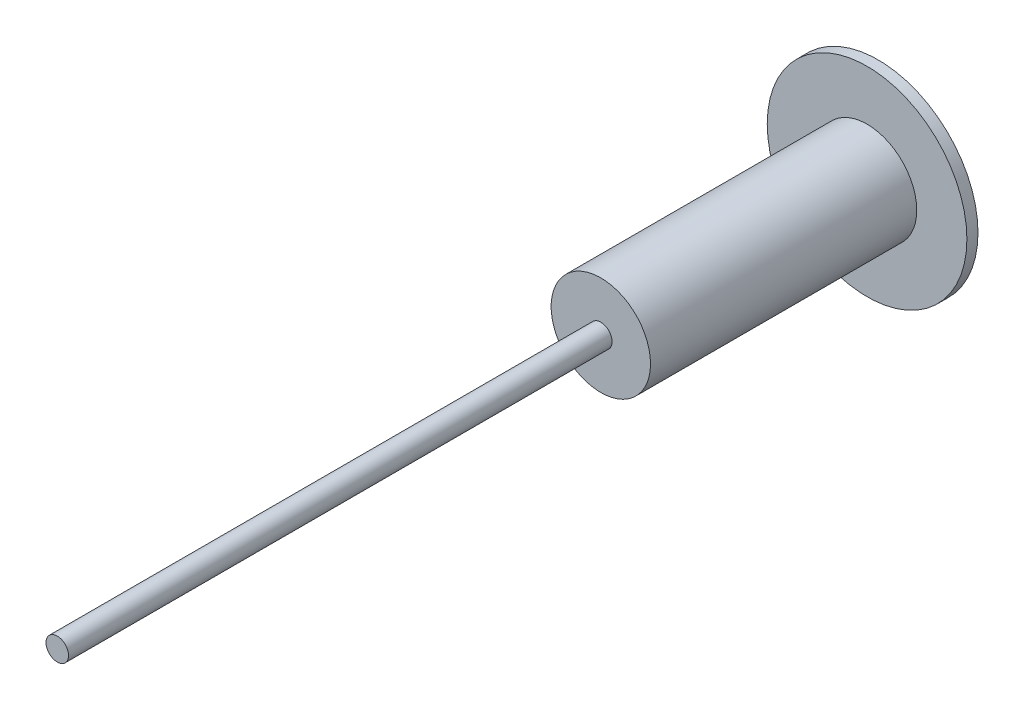
ISO-10303-21;
HEADER;
FILE_DESCRIPTION(('STEP AP214'),'2;1');
FILE_NAME('part.step','',(''),(''),'','','');
FILE_SCHEMA(('AUTOMOTIVE_DESIGN { 1 0 10303 214 1 1 1 1 }'));
ENDSEC;
DATA;
#1=APPLICATION_CONTEXT('core data for automotive mechanical design processes');
#2=APPLICATION_PROTOCOL_DEFINITION('international standard','automotive_design',2000,#1);
#3=PRODUCT_CONTEXT('',#1,'mechanical');
#4=PRODUCT('Part','Part','',(#3));
#5=PRODUCT_RELATED_PRODUCT_CATEGORY('part','',(#4));
#6=PRODUCT_DEFINITION_FORMATION('','',#4);
#7=PRODUCT_DEFINITION_CONTEXT('part definition',#1,'design');
#8=PRODUCT_DEFINITION('design','',#6,#7);
#9=PRODUCT_DEFINITION_SHAPE('','',#8);
#10=(LENGTH_UNIT() NAMED_UNIT(*) SI_UNIT(.MILLI.,.METRE.));
#11=(NAMED_UNIT(*) PLANE_ANGLE_UNIT() SI_UNIT($,.RADIAN.));
#12=(NAMED_UNIT(*) SI_UNIT($,.STERADIAN.) SOLID_ANGLE_UNIT());
#13=UNCERTAINTY_MEASURE_WITH_UNIT(LENGTH_MEASURE(1.E-05),#10,'distance_accuracy_value','');
#14=(GEOMETRIC_REPRESENTATION_CONTEXT(3) GLOBAL_UNCERTAINTY_ASSIGNED_CONTEXT((#13)) GLOBAL_UNIT_ASSIGNED_CONTEXT((#10,
#11,#12)) REPRESENTATION_CONTEXT('',''));
#15=CARTESIAN_POINT('',(0.,0.,0.));
#16=DIRECTION('',(0.,0.,1.));
#17=DIRECTION('',(1.,0.,0.));
#18=AXIS2_PLACEMENT_3D('',#15,#16,#17);
#19=CARTESIAN_POINT('',(0.,0.,-2000.));
#20=DIRECTION('',(0.,0.,-1.));
#21=DIRECTION('',(-1.,0.,0.));
#22=AXIS2_PLACEMENT_3D('',#19,#20,#21);
#23=CYLINDRICAL_SURFACE('',#22,450.);
#24=CARTESIAN_POINT('',(0.,0.,-2000.));
#25=DIRECTION('',(0.,0.,1.));
#26=DIRECTION('',(1.,0.,0.));
#27=AXIS2_PLACEMENT_3D('',#24,#25,#26);
#28=CIRCLE('',#27,450.);
#29=CARTESIAN_POINT('',(450.,0.,-2000.));
#30=VERTEX_POINT('',#29);
#31=EDGE_CURVE('E54',#30,#30,#28,.T.);
#32=ORIENTED_EDGE('',*,*,#31,.F.);
#33=EDGE_LOOP('',(#32));
#34=FACE_BOUND('',#33,.T.);
#35=CARTESIAN_POINT('',(0.,0.,-2050.));
#36=DIRECTION('',(0.,0.,1.));
#37=DIRECTION('',(1.,0.,0.));
#38=AXIS2_PLACEMENT_3D('',#35,#36,#37);
#39=CIRCLE('',#38,450.);
#40=CARTESIAN_POINT('',(450.,0.,-2050.));
#41=VERTEX_POINT('',#40);
#42=EDGE_CURVE('E59',#41,#41,#39,.T.);
#43=ORIENTED_EDGE('',*,*,#42,.T.);
#44=EDGE_LOOP('',(#43));
#45=FACE_BOUND('',#44,.T.);
#46=ADVANCED_FACE('F45',(#34,#45),#23,.T.);
#47=CARTESIAN_POINT('',(0.,0.,-2000.));
#48=DIRECTION('',(0.,0.,1.));
#49=DIRECTION('',(1.,0.,0.));
#50=AXIS2_PLACEMENT_3D('',#47,#48,#49);
#51=PLANE('',#50);
#52=CARTESIAN_POINT('',(0.,0.,-2000.));
#53=DIRECTION('',(0.,0.,1.));
#54=DIRECTION('',(1.,0.,0.));
#55=AXIS2_PLACEMENT_3D('',#52,#53,#54);
#56=CIRCLE('',#55,223.901);
#57=CARTESIAN_POINT('',(223.901,0.,-2000.));
#58=VERTEX_POINT('',#57);
#59=EDGE_CURVE('E65',#58,#58,#56,.T.);
#60=ORIENTED_EDGE('',*,*,#59,.F.);
#61=EDGE_LOOP('',(#60));
#62=FACE_BOUND('',#61,.T.);
#63=ORIENTED_EDGE('',*,*,#31,.T.);
#64=EDGE_LOOP('',(#63));
#65=FACE_BOUND('',#64,.T.);
#66=ADVANCED_FACE('F94',(#62,#65),#51,.T.);
#67=CARTESIAN_POINT('',(0.,0.,-2050.));
#68=DIRECTION('',(0.,0.,1.));
#69=DIRECTION('',(1.,0.,0.));
#70=AXIS2_PLACEMENT_3D('',#67,#68,#69);
#71=PLANE('',#70);
#72=ORIENTED_EDGE('',*,*,#42,.F.);
#73=EDGE_LOOP('',(#72));
#74=FACE_BOUND('',#73,.T.);
#75=ADVANCED_FACE('F90',(#74),#71,.F.);
#76=CARTESIAN_POINT('',(0.,0.,-800.));
#77=DIRECTION('',(0.,0.,-1.));
#78=DIRECTION('',(-1.,0.,0.));
#79=AXIS2_PLACEMENT_3D('',#76,#77,#78);
#80=CYLINDRICAL_SURFACE('',#79,223.901);
#81=CARTESIAN_POINT('',(0.,0.,-800.));
#82=DIRECTION('',(0.,0.,1.));
#83=DIRECTION('',(1.,0.,0.));
#84=AXIS2_PLACEMENT_3D('',#81,#82,#83);
#85=CIRCLE('',#84,223.901);
#86=CARTESIAN_POINT('',(223.901,0.,-800.));
#87=VERTEX_POINT('',#86);
#88=EDGE_CURVE('E69',#87,#87,#85,.T.);
#89=ORIENTED_EDGE('',*,*,#88,.F.);
#90=EDGE_LOOP('',(#89));
#91=FACE_BOUND('',#90,.T.);
#92=ORIENTED_EDGE('',*,*,#59,.T.);
#93=EDGE_LOOP('',(#92));
#94=FACE_BOUND('',#93,.T.);
#95=ADVANCED_FACE('F83',(#91,#94),#80,.T.);
#96=CARTESIAN_POINT('',(0.,0.,-800.));
#97=DIRECTION('',(0.,0.,1.));
#98=DIRECTION('',(1.,0.,0.));
#99=AXIS2_PLACEMENT_3D('',#96,#97,#98);
#100=PLANE('',#99);
#101=CARTESIAN_POINT('',(0.,0.,-800.));
#102=DIRECTION('',(0.,0.,1.));
#103=DIRECTION('',(1.,0.,0.));
#104=AXIS2_PLACEMENT_3D('',#101,#102,#103);
#105=CIRCLE('',#104,50.8);
#106=CARTESIAN_POINT('',(50.8,0.,-800.));
#107=VERTEX_POINT('',#106);
#108=EDGE_CURVE('E49',#107,#107,#105,.T.);
#109=ORIENTED_EDGE('',*,*,#108,.F.);
#110=EDGE_LOOP('',(#109));
#111=FACE_BOUND('',#110,.T.);
#112=ORIENTED_EDGE('',*,*,#88,.T.);
#113=EDGE_LOOP('',(#112));
#114=FACE_BOUND('',#113,.T.);
#115=ADVANCED_FACE('F80',(#111,#114),#100,.T.);
#116=CARTESIAN_POINT('',(0.,0.,1650.));
#117=DIRECTION('',(0.,0.,1.));
#118=DIRECTION('',(1.,0.,0.));
#119=AXIS2_PLACEMENT_3D('',#116,#117,#118);
#120=PLANE('',#119);
#121=CARTESIAN_POINT('',(0.,0.,1650.));
#122=DIRECTION('',(0.,0.,1.));
#123=DIRECTION('',(1.,0.,0.));
#124=AXIS2_PLACEMENT_3D('',#121,#122,#123);
#125=CIRCLE('',#124,50.8);
#126=CARTESIAN_POINT('',(50.8,0.,1650.));
#127=VERTEX_POINT('',#126);
#128=EDGE_CURVE('E10',#127,#127,#125,.T.);
#129=ORIENTED_EDGE('',*,*,#128,.T.);
#130=EDGE_LOOP('',(#129));
#131=FACE_BOUND('',#130,.T.);
#132=ADVANCED_FACE('F82',(#131),#120,.T.);
#133=CARTESIAN_POINT('',(0.,0.,1650.));
#134=DIRECTION('',(0.,0.,-1.));
#135=DIRECTION('',(-1.,0.,0.));
#136=AXIS2_PLACEMENT_3D('',#133,#134,#135);
#137=CYLINDRICAL_SURFACE('',#136,50.8);
#138=ORIENTED_EDGE('',*,*,#108,.T.);
#139=EDGE_LOOP('',(#138));
#140=FACE_BOUND('',#139,.T.);
#141=ORIENTED_EDGE('',*,*,#128,.F.);
#142=EDGE_LOOP('',(#141));
#143=FACE_BOUND('',#142,.T.);
#144=ADVANCED_FACE('F47',(#140,#143),#137,.T.);
#145=CLOSED_SHELL('',(#46,#66,#75,#95,#115,#132,#144));
#146=MANIFOLD_SOLID_BREP('B2',#145);
#147=ADVANCED_BREP_SHAPE_REPRESENTATION('',(#18,#146),#14);
#148=SHAPE_DEFINITION_REPRESENTATION(#9,#147);
ENDSEC;
END-ISO-10303-21;
